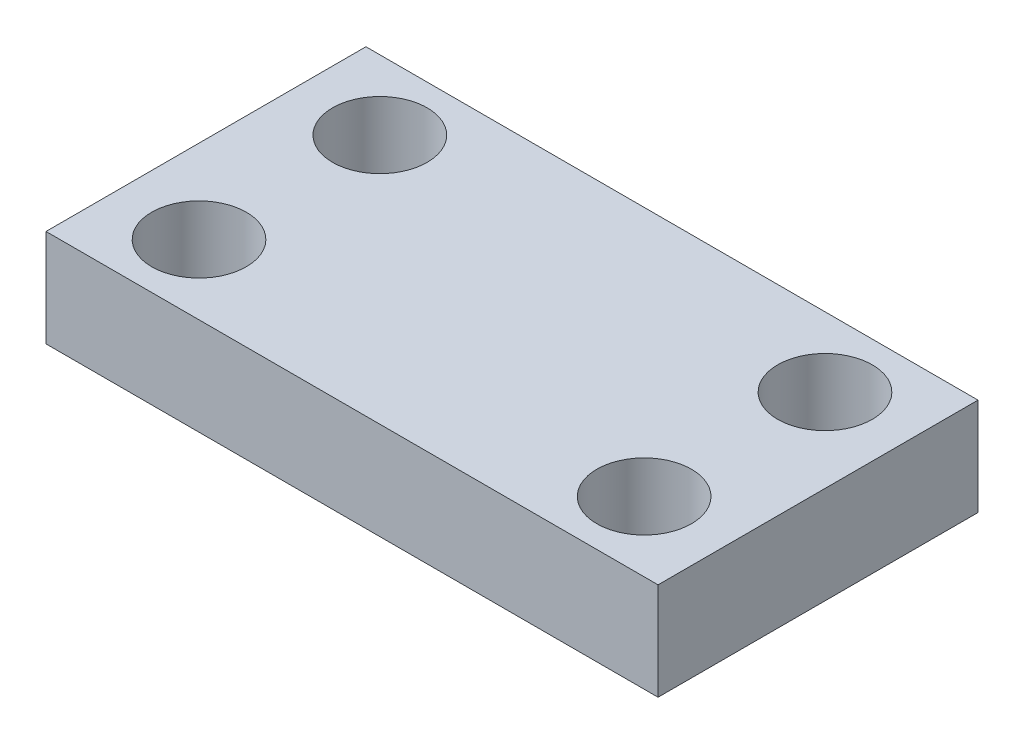
ISO-10303-21;
HEADER;
FILE_DESCRIPTION(('STEP AP214'),'2;1');
FILE_NAME('part.step','',(''),(''),'','','');
FILE_SCHEMA(('AUTOMOTIVE_DESIGN { 1 0 10303 214 1 1 1 1 }'));
ENDSEC;
DATA;
#1=APPLICATION_CONTEXT('core data for automotive mechanical design processes');
#2=APPLICATION_PROTOCOL_DEFINITION('international standard','automotive_design',2000,#1);
#3=PRODUCT_CONTEXT('',#1,'mechanical');
#4=PRODUCT('Part','Part','',(#3));
#5=PRODUCT_RELATED_PRODUCT_CATEGORY('part','',(#4));
#6=PRODUCT_DEFINITION_FORMATION('','',#4);
#7=PRODUCT_DEFINITION_CONTEXT('part definition',#1,'design');
#8=PRODUCT_DEFINITION('design','',#6,#7);
#9=PRODUCT_DEFINITION_SHAPE('','',#8);
#10=(LENGTH_UNIT() NAMED_UNIT(*) SI_UNIT(.MILLI.,.METRE.));
#11=(NAMED_UNIT(*) PLANE_ANGLE_UNIT() SI_UNIT($,.RADIAN.));
#12=(NAMED_UNIT(*) SI_UNIT($,.STERADIAN.) SOLID_ANGLE_UNIT());
#13=UNCERTAINTY_MEASURE_WITH_UNIT(LENGTH_MEASURE(1.E-05),#10,'distance_accuracy_value','');
#14=(GEOMETRIC_REPRESENTATION_CONTEXT(3) GLOBAL_UNCERTAINTY_ASSIGNED_CONTEXT((#13)) GLOBAL_UNIT_ASSIGNED_CONTEXT((#10,
#11,#12)) REPRESENTATION_CONTEXT('',''));
#15=CARTESIAN_POINT('',(0.,0.,0.));
#16=DIRECTION('',(0.,0.,1.));
#17=DIRECTION('',(1.,0.,0.));
#18=AXIS2_PLACEMENT_3D('',#15,#16,#17);
#19=CARTESIAN_POINT('',(0.,3.5,0.));
#20=DIRECTION('',(0.,1.,0.));
#21=DIRECTION('',(0.,0.,1.));
#22=AXIS2_PLACEMENT_3D('',#19,#20,#21);
#23=PLANE('',#22);
#24=CARTESIAN_POINT('',(19.,3.5,-9.));
#25=DIRECTION('',(0.,1.,0.));
#26=DIRECTION('',(0.,0.,1.));
#27=AXIS2_PLACEMENT_3D('',#24,#25,#26);
#28=CIRCLE('',#27,1.7);
#29=CARTESIAN_POINT('',(19.,3.5,-7.3));
#30=VERTEX_POINT('',#29);
#31=EDGE_CURVE('E125',#30,#30,#28,.T.);
#32=ORIENTED_EDGE('',*,*,#31,.F.);
#33=EDGE_LOOP('',(#32));
#34=FACE_BOUND('',#33,.T.);
#35=CARTESIAN_POINT('',(3.,3.5,-2.5));
#36=DIRECTION('',(0.,1.,0.));
#37=DIRECTION('',(0.,0.,1.));
#38=AXIS2_PLACEMENT_3D('',#35,#36,#37);
#39=CIRCLE('',#38,1.7);
#40=CARTESIAN_POINT('',(3.,3.5,-0.800000000000001));
#41=VERTEX_POINT('',#40);
#42=EDGE_CURVE('E104',#41,#41,#39,.T.);
#43=ORIENTED_EDGE('',*,*,#42,.F.);
#44=EDGE_LOOP('',(#43));
#45=FACE_BOUND('',#44,.T.);
#46=DIRECTION('',(1.,0.,0.));
#47=VECTOR('',#46,1.);
#48=CARTESIAN_POINT('',(0.,3.5,0.));
#49=LINE('',#48,#47);
#50=CARTESIAN_POINT('',(0.,3.5,0.));
#51=VERTEX_POINT('',#50);
#52=CARTESIAN_POINT('',(22.,3.5,0.));
#53=VERTEX_POINT('',#52);
#54=EDGE_CURVE('E89',#51,#53,#49,.T.);
#55=ORIENTED_EDGE('',*,*,#54,.T.);
#56=DIRECTION('',(0.,0.,-1.));
#57=VECTOR('',#56,1.);
#58=CARTESIAN_POINT('',(22.,3.5,0.));
#59=LINE('',#58,#57);
#60=CARTESIAN_POINT('',(22.,3.5,-11.5));
#61=VERTEX_POINT('',#60);
#62=EDGE_CURVE('E84',#53,#61,#59,.T.);
#63=ORIENTED_EDGE('',*,*,#62,.T.);
#64=DIRECTION('',(-1.,0.,0.));
#65=VECTOR('',#64,1.);
#66=CARTESIAN_POINT('',(0.,3.5,-11.5));
#67=LINE('',#66,#65);
#68=CARTESIAN_POINT('',(0.,3.5,-11.5));
#69=VERTEX_POINT('',#68);
#70=EDGE_CURVE('E87',#61,#69,#67,.T.);
#71=ORIENTED_EDGE('',*,*,#70,.T.);
#72=DIRECTION('',(0.,0.,1.));
#73=VECTOR('',#72,1.);
#74=CARTESIAN_POINT('',(0.,3.5,0.));
#75=LINE('',#74,#73);
#76=EDGE_CURVE('E54',#69,#51,#75,.T.);
#77=ORIENTED_EDGE('',*,*,#76,.T.);
#78=EDGE_LOOP('',(#55,#63,#71,#77));
#79=FACE_BOUND('',#78,.T.);
#80=CARTESIAN_POINT('',(3.,3.5,-9.));
#81=DIRECTION('',(0.,1.,0.));
#82=DIRECTION('',(0.,0.,1.));
#83=AXIS2_PLACEMENT_3D('',#80,#81,#82);
#84=CIRCLE('',#83,1.7);
#85=CARTESIAN_POINT('',(3.,3.5,-7.3));
#86=VERTEX_POINT('',#85);
#87=EDGE_CURVE('E119',#86,#86,#84,.T.);
#88=ORIENTED_EDGE('',*,*,#87,.F.);
#89=EDGE_LOOP('',(#88));
#90=FACE_BOUND('',#89,.T.);
#91=CARTESIAN_POINT('',(19.,3.5,-2.5));
#92=DIRECTION('',(0.,1.,0.));
#93=DIRECTION('',(0.,0.,1.));
#94=AXIS2_PLACEMENT_3D('',#91,#92,#93);
#95=CIRCLE('',#94,1.7);
#96=CARTESIAN_POINT('',(19.,3.5,-0.800000000000001));
#97=VERTEX_POINT('',#96);
#98=EDGE_CURVE('E131',#97,#97,#95,.T.);
#99=ORIENTED_EDGE('',*,*,#98,.F.);
#100=EDGE_LOOP('',(#99));
#101=FACE_BOUND('',#100,.T.);
#102=ADVANCED_FACE('F37',(#34,#45,#79,#90,#101),#23,.T.);
#103=CARTESIAN_POINT('',(0.,0.,0.));
#104=DIRECTION('',(0.,1.,0.));
#105=DIRECTION('',(0.,0.,1.));
#106=AXIS2_PLACEMENT_3D('',#103,#104,#105);
#107=PLANE('',#106);
#108=CARTESIAN_POINT('',(19.,0.,-9.));
#109=DIRECTION('',(0.,1.,0.));
#110=DIRECTION('',(0.,0.,1.));
#111=AXIS2_PLACEMENT_3D('',#108,#109,#110);
#112=CIRCLE('',#111,1.7);
#113=CARTESIAN_POINT('',(19.,0.,-7.3));
#114=VERTEX_POINT('',#113);
#115=EDGE_CURVE('E128',#114,#114,#112,.T.);
#116=ORIENTED_EDGE('',*,*,#115,.T.);
#117=EDGE_LOOP('',(#116));
#118=FACE_BOUND('',#117,.T.);
#119=CARTESIAN_POINT('',(3.,0.,-2.5));
#120=DIRECTION('',(0.,1.,0.));
#121=DIRECTION('',(0.,0.,1.));
#122=AXIS2_PLACEMENT_3D('',#119,#120,#121);
#123=CIRCLE('',#122,1.7);
#124=CARTESIAN_POINT('',(3.,0.,-0.800000000000001));
#125=VERTEX_POINT('',#124);
#126=EDGE_CURVE('E116',#125,#125,#123,.T.);
#127=ORIENTED_EDGE('',*,*,#126,.T.);
#128=EDGE_LOOP('',(#127));
#129=FACE_BOUND('',#128,.T.);
#130=DIRECTION('',(1.,0.,0.));
#131=VECTOR('',#130,1.);
#132=CARTESIAN_POINT('',(0.,0.,0.));
#133=LINE('',#132,#131);
#134=CARTESIAN_POINT('',(0.,0.,0.));
#135=VERTEX_POINT('',#134);
#136=CARTESIAN_POINT('',(22.,0.,0.));
#137=VERTEX_POINT('',#136);
#138=EDGE_CURVE('E101',#135,#137,#133,.T.);
#139=ORIENTED_EDGE('',*,*,#138,.F.);
#140=DIRECTION('',(0.,0.,1.));
#141=VECTOR('',#140,1.);
#142=CARTESIAN_POINT('',(0.,0.,0.));
#143=LINE('',#142,#141);
#144=CARTESIAN_POINT('',(0.,0.,-11.5));
#145=VERTEX_POINT('',#144);
#146=EDGE_CURVE('E77',#145,#135,#143,.T.);
#147=ORIENTED_EDGE('',*,*,#146,.F.);
#148=DIRECTION('',(-1.,0.,0.));
#149=VECTOR('',#148,1.);
#150=CARTESIAN_POINT('',(0.,0.,-11.5));
#151=LINE('',#150,#149);
#152=CARTESIAN_POINT('',(22.,0.,-11.5));
#153=VERTEX_POINT('',#152);
#154=EDGE_CURVE('E71',#153,#145,#151,.T.);
#155=ORIENTED_EDGE('',*,*,#154,.F.);
#156=DIRECTION('',(0.,0.,-1.));
#157=VECTOR('',#156,1.);
#158=CARTESIAN_POINT('',(22.,0.,0.));
#159=LINE('',#158,#157);
#160=EDGE_CURVE('E93',#137,#153,#159,.T.);
#161=ORIENTED_EDGE('',*,*,#160,.F.);
#162=EDGE_LOOP('',(#139,#147,#155,#161));
#163=FACE_BOUND('',#162,.T.);
#164=CARTESIAN_POINT('',(3.,0.,-9.));
#165=DIRECTION('',(0.,1.,0.));
#166=DIRECTION('',(0.,0.,1.));
#167=AXIS2_PLACEMENT_3D('',#164,#165,#166);
#168=CIRCLE('',#167,1.7);
#169=CARTESIAN_POINT('',(3.,0.,-7.3));
#170=VERTEX_POINT('',#169);
#171=EDGE_CURVE('E122',#170,#170,#168,.T.);
#172=ORIENTED_EDGE('',*,*,#171,.T.);
#173=EDGE_LOOP('',(#172));
#174=FACE_BOUND('',#173,.T.);
#175=CARTESIAN_POINT('',(19.,0.,-2.5));
#176=DIRECTION('',(0.,1.,0.));
#177=DIRECTION('',(0.,0.,1.));
#178=AXIS2_PLACEMENT_3D('',#175,#176,#177);
#179=CIRCLE('',#178,1.7);
#180=CARTESIAN_POINT('',(19.,0.,-0.800000000000001));
#181=VERTEX_POINT('',#180);
#182=EDGE_CURVE('E134',#181,#181,#179,.T.);
#183=ORIENTED_EDGE('',*,*,#182,.T.);
#184=EDGE_LOOP('',(#183));
#185=FACE_BOUND('',#184,.T.);
#186=ADVANCED_FACE('F112',(#118,#129,#163,#174,#185),#107,.F.);
#187=CARTESIAN_POINT('',(0.,3.5,0.));
#188=DIRECTION('',(0.,0.,-1.));
#189=DIRECTION('',(-1.,0.,0.));
#190=AXIS2_PLACEMENT_3D('',#187,#188,#189);
#191=PLANE('',#190);
#192=ORIENTED_EDGE('',*,*,#138,.T.);
#193=DIRECTION('',(0.,-1.,0.));
#194=VECTOR('',#193,1.);
#195=CARTESIAN_POINT('',(22.,3.5,0.));
#196=LINE('',#195,#194);
#197=EDGE_CURVE('E11',#53,#137,#196,.T.);
#198=ORIENTED_EDGE('',*,*,#197,.F.);
#199=ORIENTED_EDGE('',*,*,#54,.F.);
#200=DIRECTION('',(0.,-1.,0.));
#201=VECTOR('',#200,1.);
#202=CARTESIAN_POINT('',(0.,3.5,0.));
#203=LINE('',#202,#201);
#204=EDGE_CURVE('E97',#51,#135,#203,.T.);
#205=ORIENTED_EDGE('',*,*,#204,.T.);
#206=EDGE_LOOP('',(#192,#198,#199,#205));
#207=FACE_BOUND('',#206,.T.);
#208=ADVANCED_FACE('F39',(#207),#191,.F.);
#209=CARTESIAN_POINT('',(22.,3.5,0.));
#210=DIRECTION('',(-1.,0.,0.));
#211=DIRECTION('',(0.,0.,1.));
#212=AXIS2_PLACEMENT_3D('',#209,#210,#211);
#213=PLANE('',#212);
#214=ORIENTED_EDGE('',*,*,#160,.T.);
#215=DIRECTION('',(0.,-1.,0.));
#216=VECTOR('',#215,1.);
#217=CARTESIAN_POINT('',(22.,3.5,-11.5));
#218=LINE('',#217,#216);
#219=EDGE_CURVE('E46',#61,#153,#218,.T.);
#220=ORIENTED_EDGE('',*,*,#219,.F.);
#221=ORIENTED_EDGE('',*,*,#62,.F.);
#222=ORIENTED_EDGE('',*,*,#197,.T.);
#223=EDGE_LOOP('',(#214,#220,#221,#222));
#224=FACE_BOUND('',#223,.T.);
#225=ADVANCED_FACE('F92',(#224),#213,.F.);
#226=CARTESIAN_POINT('',(0.,3.5,-11.5));
#227=DIRECTION('',(0.,0.,1.));
#228=DIRECTION('',(1.,0.,0.));
#229=AXIS2_PLACEMENT_3D('',#226,#227,#228);
#230=PLANE('',#229);
#231=ORIENTED_EDGE('',*,*,#154,.T.);
#232=DIRECTION('',(0.,-1.,0.));
#233=VECTOR('',#232,1.);
#234=CARTESIAN_POINT('',(0.,3.5,-11.5));
#235=LINE('',#234,#233);
#236=EDGE_CURVE('E94',#69,#145,#235,.T.);
#237=ORIENTED_EDGE('',*,*,#236,.F.);
#238=ORIENTED_EDGE('',*,*,#70,.F.);
#239=ORIENTED_EDGE('',*,*,#219,.T.);
#240=EDGE_LOOP('',(#231,#237,#238,#239));
#241=FACE_BOUND('',#240,.T.);
#242=ADVANCED_FACE('F95',(#241),#230,.F.);
#243=CARTESIAN_POINT('',(0.,3.5,0.));
#244=DIRECTION('',(1.,0.,0.));
#245=DIRECTION('',(0.,0.,-1.));
#246=AXIS2_PLACEMENT_3D('',#243,#244,#245);
#247=PLANE('',#246);
#248=ORIENTED_EDGE('',*,*,#146,.T.);
#249=ORIENTED_EDGE('',*,*,#204,.F.);
#250=ORIENTED_EDGE('',*,*,#76,.F.);
#251=ORIENTED_EDGE('',*,*,#236,.T.);
#252=EDGE_LOOP('',(#248,#249,#250,#251));
#253=FACE_BOUND('',#252,.T.);
#254=ADVANCED_FACE('F109',(#253),#247,.F.);
#255=CARTESIAN_POINT('',(3.,3.5,-2.5));
#256=DIRECTION('',(0.,-1.,0.));
#257=DIRECTION('',(0.,0.,-1.));
#258=AXIS2_PLACEMENT_3D('',#255,#256,#257);
#259=CYLINDRICAL_SURFACE('',#258,1.7);
#260=ORIENTED_EDGE('',*,*,#42,.T.);
#261=EDGE_LOOP('',(#260));
#262=FACE_BOUND('',#261,.T.);
#263=ORIENTED_EDGE('',*,*,#126,.F.);
#264=EDGE_LOOP('',(#263));
#265=FACE_BOUND('',#264,.T.);
#266=ADVANCED_FACE('F154',(#262,#265),#259,.F.);
#267=CARTESIAN_POINT('',(3.,3.5,-9.));
#268=DIRECTION('',(0.,-1.,0.));
#269=DIRECTION('',(0.,0.,-1.));
#270=AXIS2_PLACEMENT_3D('',#267,#268,#269);
#271=CYLINDRICAL_SURFACE('',#270,1.7);
#272=ORIENTED_EDGE('',*,*,#87,.T.);
#273=EDGE_LOOP('',(#272));
#274=FACE_BOUND('',#273,.T.);
#275=ORIENTED_EDGE('',*,*,#171,.F.);
#276=EDGE_LOOP('',(#275));
#277=FACE_BOUND('',#276,.T.);
#278=ADVANCED_FACE('F200',(#274,#277),#271,.F.);
#279=CARTESIAN_POINT('',(19.,3.5,-9.));
#280=DIRECTION('',(0.,-1.,0.));
#281=DIRECTION('',(0.,0.,-1.));
#282=AXIS2_PLACEMENT_3D('',#279,#280,#281);
#283=CYLINDRICAL_SURFACE('',#282,1.7);
#284=ORIENTED_EDGE('',*,*,#31,.T.);
#285=EDGE_LOOP('',(#284));
#286=FACE_BOUND('',#285,.T.);
#287=ORIENTED_EDGE('',*,*,#115,.F.);
#288=EDGE_LOOP('',(#287));
#289=FACE_BOUND('',#288,.T.);
#290=ADVANCED_FACE('F208',(#286,#289),#283,.F.);
#291=CARTESIAN_POINT('',(19.,3.5,-2.5));
#292=DIRECTION('',(0.,-1.,0.));
#293=DIRECTION('',(0.,0.,-1.));
#294=AXIS2_PLACEMENT_3D('',#291,#292,#293);
#295=CYLINDRICAL_SURFACE('',#294,1.7);
#296=ORIENTED_EDGE('',*,*,#98,.T.);
#297=EDGE_LOOP('',(#296));
#298=FACE_BOUND('',#297,.T.);
#299=ORIENTED_EDGE('',*,*,#182,.F.);
#300=EDGE_LOOP('',(#299));
#301=FACE_BOUND('',#300,.T.);
#302=ADVANCED_FACE('F140',(#298,#301),#295,.F.);
#303=CLOSED_SHELL('',(#102,#186,#208,#225,#242,#254,#266,#278,#290,#302));
#304=MANIFOLD_SOLID_BREP('B2',#303);
#305=ADVANCED_BREP_SHAPE_REPRESENTATION('',(#18,#304),#14);
#306=SHAPE_DEFINITION_REPRESENTATION(#9,#305);
ENDSEC;
END-ISO-10303-21;
